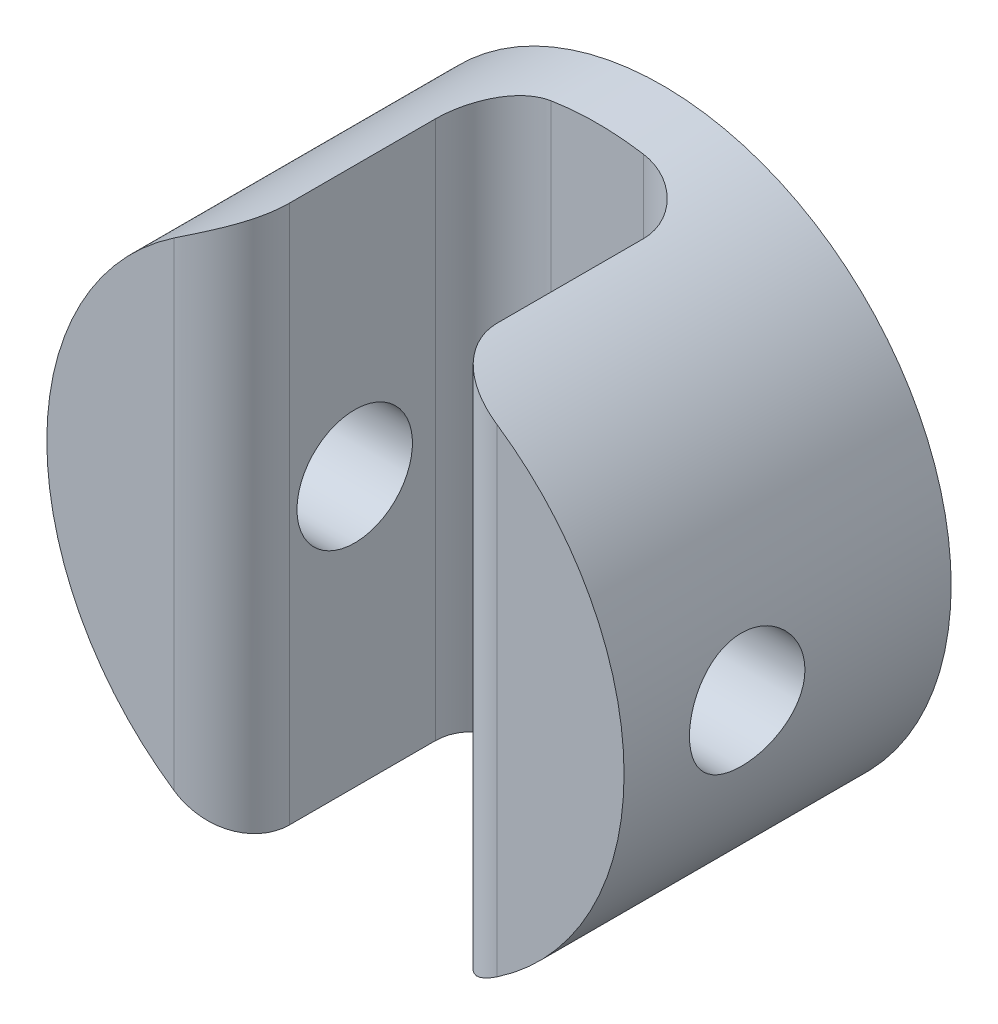
ISO-10303-21;
HEADER;
FILE_DESCRIPTION(('STEP AP214'),'2;1');
FILE_NAME('part.step','',(''),(''),'','','');
FILE_SCHEMA(('AUTOMOTIVE_DESIGN { 1 0 10303 214 1 1 1 1 }'));
ENDSEC;
DATA;
#1=APPLICATION_CONTEXT('core data for automotive mechanical design processes');
#2=APPLICATION_PROTOCOL_DEFINITION('international standard','automotive_design',2000,#1);
#3=PRODUCT_CONTEXT('',#1,'mechanical');
#4=PRODUCT('Part','Part','',(#3));
#5=PRODUCT_RELATED_PRODUCT_CATEGORY('part','',(#4));
#6=PRODUCT_DEFINITION_FORMATION('','',#4);
#7=PRODUCT_DEFINITION_CONTEXT('part definition',#1,'design');
#8=PRODUCT_DEFINITION('design','',#6,#7);
#9=PRODUCT_DEFINITION_SHAPE('','',#8);
#10=(LENGTH_UNIT() NAMED_UNIT(*) SI_UNIT(.MILLI.,.METRE.));
#11=(NAMED_UNIT(*) PLANE_ANGLE_UNIT() SI_UNIT($,.RADIAN.));
#12=(NAMED_UNIT(*) SI_UNIT($,.STERADIAN.) SOLID_ANGLE_UNIT());
#13=UNCERTAINTY_MEASURE_WITH_UNIT(LENGTH_MEASURE(1.E-05),#10,'distance_accuracy_value','');
#14=(GEOMETRIC_REPRESENTATION_CONTEXT(3) GLOBAL_UNCERTAINTY_ASSIGNED_CONTEXT((#13)) GLOBAL_UNIT_ASSIGNED_CONTEXT((#10,
#11,#12)) REPRESENTATION_CONTEXT('',''));
#15=CARTESIAN_POINT('',(0.,0.,0.));
#16=DIRECTION('',(0.,0.,1.));
#17=DIRECTION('',(1.,0.,0.));
#18=AXIS2_PLACEMENT_3D('',#15,#16,#17);
#19=CARTESIAN_POINT('',(0.,0.,8.5));
#20=DIRECTION('',(0.,0.,-1.));
#21=DIRECTION('',(-1.,0.,0.));
#22=AXIS2_PLACEMENT_3D('',#19,#20,#21);
#23=CYLINDRICAL_SURFACE('',#22,7.5);
#24=DIRECTION('',(0.,0.,-1.));
#25=VECTOR('',#24,1.);
#26=CARTESIAN_POINT('',(2.7,6.99714227381436,8.5));
#27=LINE('',#26,#25);
#28=CARTESIAN_POINT('',(2.7,6.99714227381436,3.2));
#29=VERTEX_POINT('',#28);
#30=CARTESIAN_POINT('',(2.7,6.99714227381436,7.));
#31=VERTEX_POINT('',#30);
#32=EDGE_CURVE('E105',#29,#31,#27,.F.);
#33=ORIENTED_EDGE('',*,*,#32,.T.);
#34=CARTESIAN_POINT('',(2.7,6.99714227381436,7.));
#35=CARTESIAN_POINT('',(2.69999901075075,6.99714064902579,7.03979783044758));
#36=CARTESIAN_POINT('',(2.70158501028902,6.99653088167752,7.07957622742591));
#37=CARTESIAN_POINT('',(2.70790371255194,6.99408853853974,7.15884000730107));
#38=CARTESIAN_POINT('',(2.7126360600533,6.99225610078986,7.19832542276677));
#39=CARTESIAN_POINT('',(2.73147700896505,6.9849285050591,7.31575484248));
#40=CARTESIAN_POINT('',(2.75022986375471,6.97760311004875,7.39289777237514));
#41=CARTESIAN_POINT('',(2.79938504908578,6.95802656053791,7.54267951383766));
#42=CARTESIAN_POINT('',(2.82978945530377,6.94577452835782,7.61531752019087));
#43=CARTESIAN_POINT('',(2.90104362961861,6.91631593994004,7.75418895254782));
#44=CARTESIAN_POINT('',(2.94189468728855,6.89910877198907,7.82042158645669));
#45=CARTESIAN_POINT('',(3.0331811240924,6.85946925692275,7.94585818579454));
#46=CARTESIAN_POINT('',(3.08375912976139,6.83695786148238,8.00493302945643));
#47=CARTESIAN_POINT('',(3.19212325955173,6.78703935801539,8.11358635338742));
#48=CARTESIAN_POINT('',(3.24990874943115,6.75963268067067,8.16316566826891));
#49=CARTESIAN_POINT('',(3.37412890684956,6.69852984317404,8.25467962144271));
#50=CARTESIAN_POINT('',(3.44086858461857,6.66456460641318,8.29601902238436));
#51=CARTESIAN_POINT('',(3.57797285348157,6.59197585145777,8.36713720085007));
#52=CARTESIAN_POINT('',(3.64834307662291,6.55334496291006,8.39689736512886));
#53=CARTESIAN_POINT('',(3.79928593747917,6.46713564934164,8.4479349962014));
#54=CARTESIAN_POINT('',(3.88006131293424,6.4190402548443,8.46774698073349));
#55=CARTESIAN_POINT('',(4.00074847013445,6.34399458254306,8.48726593628329));
#56=CARTESIAN_POINT('',(4.04084938347569,6.31852855187642,8.49207274598602));
#57=CARTESIAN_POINT('',(4.12071544362077,6.26673503591208,8.4984370225042));
#58=CARTESIAN_POINT('',(4.1604807961839,6.24040813540344,8.49999665039759));
#59=CARTESIAN_POINT('',(4.2,6.2136945531624,8.5));
#60=B_SPLINE_CURVE_WITH_KNOTS('',3,(#34,#35,#36,#37,#38,#39,#40,#41,#42,#43,#44,#45,#46,#47,#48,
#49,#50,#51,#52,#53,#54,#55,#56,#57,#58,#59),.UNSPECIFIED.,.F.,.F.,(4,2,2,2,2,2,2,2,2,2,2,2,4),
(0.,0.119318807319627,0.238624145810228,0.476566349535827,0.71455096141897,0.952564965191399,
1.1943795814936,1.43617293366244,1.69171953690056,1.94767524240694,2.23465635336297,
2.37779672895484,2.52084181067769),.UNSPECIFIED.);
#61=CARTESIAN_POINT('',(4.2,6.21369455316239,8.5));
#62=VERTEX_POINT('',#61);
#63=EDGE_CURVE('E182',#31,#62,#60,.T.);
#64=ORIENTED_EDGE('',*,*,#63,.T.);
#65=CARTESIAN_POINT('',(0.,0.,8.5));
#66=DIRECTION('',(0.,0.,1.));
#67=DIRECTION('',(1.,0.,0.));
#68=AXIS2_PLACEMENT_3D('',#65,#66,#67);
#69=CIRCLE('',#68,7.5);
#70=CARTESIAN_POINT('',(4.2,-6.21369455316239,8.5));
#71=VERTEX_POINT('',#70);
#72=EDGE_CURVE('E232',#71,#62,#69,.T.);
#73=ORIENTED_EDGE('',*,*,#72,.F.);
#74=CARTESIAN_POINT('',(4.2,-6.21369455316239,8.5));
#75=CARTESIAN_POINT('',(4.15611963408237,-6.24335706880683,8.49999551095912));
#76=CARTESIAN_POINT('',(4.11193392579509,-6.27254245859217,8.4980727699554));
#77=CARTESIAN_POINT('',(4.02317639226095,-6.32983747982932,8.49020992562932));
#78=CARTESIAN_POINT('',(3.97860428665225,-6.35794623289555,8.48426661286554));
#79=CARTESIAN_POINT('',(3.8442433054268,-6.44071822127688,8.46004678259562));
#80=CARTESIAN_POINT('',(3.75431648891797,-6.49348526769673,8.43537605340667));
#81=CARTESIAN_POINT('',(3.57714735550396,-6.59275324153459,8.36787754574778));
#82=CARTESIAN_POINT('',(3.48992121011476,-6.63922057200203,8.32495710494464));
#83=CARTESIAN_POINT('',(3.3230854103763,-6.72427226897459,8.22091254925804));
#84=CARTESIAN_POINT('',(3.24345115619362,-6.76288259028807,8.15985006531398));
#85=CARTESIAN_POINT('',(3.10615205089179,-6.82691681893976,8.03013961304627));
#86=CARTESIAN_POINT('',(3.04697280758879,-6.85341641231361,7.96362155036336));
#87=CARTESIAN_POINT('',(2.94049438580119,-6.89977364043884,7.81954570161062));
#88=CARTESIAN_POINT('',(2.89319851472378,-6.91962942657961,7.74198485147632));
#89=CARTESIAN_POINT('',(2.81708282160569,-6.95094029241974,7.58673420113851));
#90=CARTESIAN_POINT('',(2.78688022943815,-6.9630408785615,7.5098471274198));
#91=CARTESIAN_POINT('',(2.73946636114235,-6.98183249196476,7.35161451985347));
#92=CARTESIAN_POINT('',(2.72223154655002,-6.98853332217217,7.27027735299172));
#93=CARTESIAN_POINT('',(2.7078915799878,-6.99409280425032,7.15686890115941));
#94=CARTESIAN_POINT('',(2.70493192347099,-6.99523749777896,7.12555272553583));
#95=CARTESIAN_POINT('',(2.70098855793507,-6.99676106467131,7.06282946262944));
#96=CARTESIAN_POINT('',(2.70000160024017,-6.99714119713438,7.03142261025558));
#97=CARTESIAN_POINT('',(2.7,-6.99714227381436,7.));
#98=B_SPLINE_CURVE_WITH_KNOTS('',3,(#74,#75,#76,#77,#78,#79,#80,#81,#82,#83,#84,#85,#86,#87,#88,
#89,#90,#91,#92,#93,#94,#95,#96,#97),.UNSPECIFIED.,.F.,.F.,(4,2,2,2,2,2,2,2,2,2,2,4),(0.,
0.15882283075244,0.317772592455626,0.637484702239438,0.958839898167589,1.27911565274865,
1.55624736253,1.833456119011,2.08269305146702,2.33147648276226,2.42585064936943,
2.52006927043205),.UNSPECIFIED.);
#99=CARTESIAN_POINT('',(2.7,-6.99714227381436,7.));
#100=VERTEX_POINT('',#99);
#101=EDGE_CURVE('E175',#71,#100,#98,.T.);
#102=ORIENTED_EDGE('',*,*,#101,.T.);
#103=DIRECTION('',(0.,0.,-1.));
#104=VECTOR('',#103,1.);
#105=CARTESIAN_POINT('',(2.7,-6.99714227381436,8.5));
#106=LINE('',#105,#104);
#107=CARTESIAN_POINT('',(2.7,-6.99714227381436,3.2));
#108=VERTEX_POINT('',#107);
#109=EDGE_CURVE('E124',#100,#108,#106,.T.);
#110=ORIENTED_EDGE('',*,*,#109,.T.);
#111=CARTESIAN_POINT('',(2.7,-6.99714227381436,3.2));
#112=CARTESIAN_POINT('',(2.70000125296468,-6.99713962337673,3.15951193135814));
#113=CARTESIAN_POINT('',(2.69835961966364,-6.99777547046994,3.11904445299375));
#114=CARTESIAN_POINT('',(2.69182061132891,-7.00029429228222,3.03842269166137));
#115=CARTESIAN_POINT('',(2.68692406854953,-7.0021769482018,2.99826833128626));
#116=CARTESIAN_POINT('',(2.6674473057059,-7.00963114859332,2.87896692587078));
#117=CARTESIAN_POINT('',(2.64807939215009,-7.01700941231577,2.80065734306411));
#118=CARTESIAN_POINT('',(2.59731346685796,-7.03595660080242,2.64869052961801));
#119=CARTESIAN_POINT('',(2.56592139674573,-7.04752345565975,2.57503102209406));
#120=CARTESIAN_POINT('',(2.49214676702811,-7.07394765910813,2.43404351707832));
#121=CARTESIAN_POINT('',(2.44975788542509,-7.08880689975164,2.36671919208228));
#122=CARTESIAN_POINT('',(2.35348293661988,-7.12136130631972,2.23760765402669));
#123=CARTESIAN_POINT('',(2.29923237903798,-7.1391404613452,2.17611387785227));
#124=CARTESIAN_POINT('',(2.18167724451883,-7.17593721762506,2.06291061543522));
#125=CARTESIAN_POINT('',(2.11836942746737,-7.19495526074335,2.01120464609467));
#126=CARTESIAN_POINT('',(1.9807167592102,-7.23409546746183,1.91632205529297));
#127=CARTESIAN_POINT('',(1.90596781240558,-7.25422335189708,1.87373302516663));
#128=CARTESIAN_POINT('',(1.75008819624826,-7.29339688274251,1.80187285626729));
#129=CARTESIAN_POINT('',(1.6689614673731,-7.31244318506541,1.77259356882458));
#130=CARTESIAN_POINT('',(1.52314676077358,-7.34398524656892,1.73378947900306));
#131=CARTESIAN_POINT('',(1.45936512565716,-7.35693490282287,1.72116778239895));
#132=CARTESIAN_POINT('',(1.33045185722167,-7.38134590470554,1.70426624660359));
#133=CARTESIAN_POINT('',(1.26532067117927,-7.39280773457138,1.69998368691991));
#134=CARTESIAN_POINT('',(1.2,-7.40337760755184,1.7));
#135=B_SPLINE_CURVE_WITH_KNOTS('',3,(#111,#112,#113,#114,#115,#116,#117,#118,#119,#120,#121,
#122,#123,#124,#125,#126,#127,#128,#129,#130,#131,#132,#133,#134),.UNSPECIFIED.,.F.,.F.,(4,2,2,
2,2,2,2,2,2,2,2,4),(0.,0.121385706498105,0.242740387574913,0.484490084742728,0.726120477356751,
0.967890090784091,1.21852218084326,1.46924415644351,1.73308025163878,1.99675459927851,
2.19510940384687,2.39339948790345),.UNSPECIFIED.);
#136=CARTESIAN_POINT('',(1.2,-7.40337760755184,1.7));
#137=VERTEX_POINT('',#136);
#138=EDGE_CURVE('E112',#108,#137,#135,.T.);
#139=ORIENTED_EDGE('',*,*,#138,.T.);
#140=CARTESIAN_POINT('',(0.,0.,1.7));
#141=DIRECTION('',(0.,0.,-1.));
#142=DIRECTION('',(-1.,0.,0.));
#143=AXIS2_PLACEMENT_3D('',#140,#141,#142);
#144=CIRCLE('',#143,7.5);
#145=CARTESIAN_POINT('',(-1.2,-7.40337760755184,1.7));
#146=VERTEX_POINT('',#145);
#147=EDGE_CURVE('E132',#137,#146,#144,.T.);
#148=ORIENTED_EDGE('',*,*,#147,.T.);
#149=CARTESIAN_POINT('',(-1.2,-7.40337760755184,1.7));
#150=CARTESIAN_POINT('',(-1.24300927927867,-7.39640849561792,1.7000000568597));
#151=CARTESIAN_POINT('',(-1.28593375830723,-7.38906367404699,1.70185074555048));
#152=CARTESIAN_POINT('',(-1.37133566686447,-7.37369078453554,1.70920087043045));
#153=CARTESIAN_POINT('',(-1.41381319955502,-7.36566287832897,1.71469944499383));
#154=CARTESIAN_POINT('',(-1.53996823675266,-7.34069538736141,1.73655119518603));
#155=CARTESIAN_POINT('',(-1.62259723576248,-7.32283466137035,1.75826099514155));
#156=CARTESIAN_POINT('',(-1.78259670298157,-7.28554150519219,1.81515358479985));
#157=CARTESIAN_POINT('',(-1.85996925647975,-7.266109705047,1.85033099457077));
#158=CARTESIAN_POINT('',(-2.00762254649971,-7.2267069178112,1.93314950421742));
#159=CARTESIAN_POINT('',(-2.07790072689887,-7.20673573964301,1.98079507435218));
#160=CARTESIAN_POINT('',(-2.2109008172675,-7.16706624816437,2.08844715239278));
#161=CARTESIAN_POINT('',(-2.27343819870841,-7.14738193094582,2.14868712678051));
#162=CARTESIAN_POINT('',(-2.38747029866222,-7.11010494419513,2.27943742940958));
#163=CARTESIAN_POINT('',(-2.43896405509274,-7.09251245695541,2.34994865154868));
#164=CARTESIAN_POINT('',(-2.52856466520879,-7.06106160193352,2.49834332811706));
#165=CARTESIAN_POINT('',(-2.56685381662891,-7.04715305547881,2.57610583995719));
#166=CARTESIAN_POINT('',(-2.62957781524466,-7.0239911146211,2.73762983180682));
#167=CARTESIAN_POINT('',(-2.65403243666527,-7.01473107806937,2.82138255577644));
#168=CARTESIAN_POINT('',(-2.68066454324547,-7.00457983188053,2.95493712439231));
#169=CARTESIAN_POINT('',(-2.6879056220673,-7.00180026814942,3.00364119345118));
#170=CARTESIAN_POINT('',(-2.69757421982452,-6.99807854917595,3.10155359660865));
#171=CARTESIAN_POINT('',(-2.70000563709297,-6.99713490589123,3.15076148979982));
#172=CARTESIAN_POINT('',(-2.7,-6.99714227381436,3.2));
#173=B_SPLINE_CURVE_WITH_KNOTS('',3,(#149,#150,#151,#152,#153,#154,#155,#156,#157,#158,#159,
#160,#161,#162,#163,#164,#165,#166,#167,#168,#169,#170,#171,#172),.UNSPECIFIED.,.F.,.F.,(4,2,2,
2,2,2,2,2,2,2,2,4),(0.,0.130624585449255,0.261218328523449,0.521718653856982,0.782115025025229,
1.04260488535717,1.30843704825689,1.57429236013547,1.83631479735607,2.0979617634134,
2.24566938673828,2.39325724075668),.UNSPECIFIED.);
#174=CARTESIAN_POINT('',(-2.7,-6.99714227381436,3.2));
#175=VERTEX_POINT('',#174);
#176=EDGE_CURVE('E46',#146,#175,#173,.T.);
#177=ORIENTED_EDGE('',*,*,#176,.T.);
#178=DIRECTION('',(0.,0.,-1.));
#179=VECTOR('',#178,1.);
#180=CARTESIAN_POINT('',(-2.7,-6.99714227381436,8.5));
#181=LINE('',#180,#179);
#182=CARTESIAN_POINT('',(-2.7,-6.99714227381436,7.));
#183=VERTEX_POINT('',#182);
#184=EDGE_CURVE('E229',#175,#183,#181,.F.);
#185=ORIENTED_EDGE('',*,*,#184,.T.);
#186=CARTESIAN_POINT('',(-2.7,-6.99714227381436,7.));
#187=CARTESIAN_POINT('',(-2.69999901075075,-6.99714064902579,7.03979783044758));
#188=CARTESIAN_POINT('',(-2.70158501028902,-6.99653088167752,7.07957622742591));
#189=CARTESIAN_POINT('',(-2.70790371255194,-6.99408853853974,7.15884000730107));
#190=CARTESIAN_POINT('',(-2.7126360600533,-6.99225610078986,7.19832542276677));
#191=CARTESIAN_POINT('',(-2.73147700896505,-6.9849285050591,7.31575484248));
#192=CARTESIAN_POINT('',(-2.75022986375471,-6.97760311004875,7.39289777237514));
#193=CARTESIAN_POINT('',(-2.79938504908578,-6.95802656053791,7.54267951383766));
#194=CARTESIAN_POINT('',(-2.82978945530377,-6.94577452835782,7.61531752019087));
#195=CARTESIAN_POINT('',(-2.90104362961861,-6.91631593994004,7.75418895254782));
#196=CARTESIAN_POINT('',(-2.94189468728855,-6.89910877198907,7.82042158645669));
#197=CARTESIAN_POINT('',(-3.0331811240924,-6.85946925692275,7.94585818579454));
#198=CARTESIAN_POINT('',(-3.08375912976139,-6.83695786148238,8.00493302945643));
#199=CARTESIAN_POINT('',(-3.19212325955173,-6.78703935801539,8.11358635338742));
#200=CARTESIAN_POINT('',(-3.24990874943115,-6.75963268067067,8.16316566826891));
#201=CARTESIAN_POINT('',(-3.37412890684956,-6.69852984317404,8.25467962144271));
#202=CARTESIAN_POINT('',(-3.44086858461857,-6.66456460641318,8.29601902238436));
#203=CARTESIAN_POINT('',(-3.57797285348157,-6.59197585145777,8.36713720085007));
#204=CARTESIAN_POINT('',(-3.64834307662291,-6.55334496291006,8.39689736512886));
#205=CARTESIAN_POINT('',(-3.79928593747917,-6.46713564934164,8.4479349962014));
#206=CARTESIAN_POINT('',(-3.88006131293424,-6.4190402548443,8.46774698073349));
#207=CARTESIAN_POINT('',(-4.00074847013445,-6.34399458254306,8.48726593628329));
#208=CARTESIAN_POINT('',(-4.04084938347569,-6.31852855187643,8.49207274598602));
#209=CARTESIAN_POINT('',(-4.12071544362077,-6.26673503591208,8.4984370225042));
#210=CARTESIAN_POINT('',(-4.1604807961839,-6.24040813540344,8.49999665039759));
#211=CARTESIAN_POINT('',(-4.2,-6.2136945531624,8.5));
#212=B_SPLINE_CURVE_WITH_KNOTS('',3,(#186,#187,#188,#189,#190,#191,#192,#193,#194,#195,#196,
#197,#198,#199,#200,#201,#202,#203,#204,#205,#206,#207,#208,#209,#210,#211),.UNSPECIFIED.,.F.,
.F.,(4,2,2,2,2,2,2,2,2,2,2,2,4),(0.,0.119318807319627,0.238624145810228,0.476566349535827,
0.714550961418972,0.952564965191399,1.1943795814936,1.43617293366244,1.69171953690056,
1.94767524240693,2.23465635336297,2.37779672895484,2.52084181067768),.UNSPECIFIED.);
#213=CARTESIAN_POINT('',(-4.2,-6.21369455316239,8.5));
#214=VERTEX_POINT('',#213);
#215=EDGE_CURVE('E53',#183,#214,#212,.T.);
#216=ORIENTED_EDGE('',*,*,#215,.T.);
#217=CARTESIAN_POINT('',(-4.2,6.21369455316239,8.5));
#218=VERTEX_POINT('',#217);
#219=EDGE_CURVE('E227',#218,#214,#69,.T.);
#220=ORIENTED_EDGE('',*,*,#219,.F.);
#221=CARTESIAN_POINT('',(-4.2,6.21369455316239,8.5));
#222=CARTESIAN_POINT('',(-4.15611963408237,6.24335706880683,8.49999551095912));
#223=CARTESIAN_POINT('',(-4.11193392579509,6.27254245859217,8.4980727699554));
#224=CARTESIAN_POINT('',(-4.02317639226095,6.32983747982932,8.49020992562932));
#225=CARTESIAN_POINT('',(-3.97860428665225,6.35794623289555,8.48426661286554));
#226=CARTESIAN_POINT('',(-3.8442433054268,6.44071822127688,8.46004678259562));
#227=CARTESIAN_POINT('',(-3.75431648891797,6.49348526769673,8.43537605340667));
#228=CARTESIAN_POINT('',(-3.57714735550396,6.59275324153459,8.36787754574778));
#229=CARTESIAN_POINT('',(-3.48992121011476,6.63922057200203,8.32495710494464));
#230=CARTESIAN_POINT('',(-3.3230854103763,6.72427226897459,8.22091254925804));
#231=CARTESIAN_POINT('',(-3.24345115619362,6.76288259028807,8.15985006531398));
#232=CARTESIAN_POINT('',(-3.10615205089179,6.82691681893976,8.03013961304627));
#233=CARTESIAN_POINT('',(-3.04697280758879,6.85341641231361,7.96362155036336));
#234=CARTESIAN_POINT('',(-2.94049438580119,6.89977364043884,7.81954570161062));
#235=CARTESIAN_POINT('',(-2.89319851472378,6.91962942657961,7.74198485147632));
#236=CARTESIAN_POINT('',(-2.81708282160569,6.95094029241974,7.58673420113851));
#237=CARTESIAN_POINT('',(-2.78688022943815,6.96304087856151,7.5098471274198));
#238=CARTESIAN_POINT('',(-2.73946636114234,6.98183249196477,7.35161451985347));
#239=CARTESIAN_POINT('',(-2.72223154655002,6.98853332217217,7.27027735299172));
#240=CARTESIAN_POINT('',(-2.7078915799878,6.99409280425032,7.15686890115941));
#241=CARTESIAN_POINT('',(-2.70493192347099,6.99523749777896,7.12555272553582));
#242=CARTESIAN_POINT('',(-2.70098855793507,6.99676106467131,7.06282946262944));
#243=CARTESIAN_POINT('',(-2.70000160024017,6.99714119713438,7.03142261025558));
#244=CARTESIAN_POINT('',(-2.7,6.99714227381436,7.));
#245=B_SPLINE_CURVE_WITH_KNOTS('',3,(#221,#222,#223,#224,#225,#226,#227,#228,#229,#230,#231,
#232,#233,#234,#235,#236,#237,#238,#239,#240,#241,#242,#243,#244),.UNSPECIFIED.,.F.,.F.,(4,2,2,
2,2,2,2,2,2,2,2,4),(0.,0.15882283075244,0.317772592455626,0.637484702239438,0.958839898167589,
1.27911565274865,1.55624736253,1.833456119011,2.08269305146702,2.33147648276226,
2.42585064936943,2.52006927043205),.UNSPECIFIED.);
#246=CARTESIAN_POINT('',(-2.7,6.99714227381436,7.));
#247=VERTEX_POINT('',#246);
#248=EDGE_CURVE('E130',#218,#247,#245,.T.);
#249=ORIENTED_EDGE('',*,*,#248,.T.);
#250=DIRECTION('',(0.,0.,-1.));
#251=VECTOR('',#250,1.);
#252=CARTESIAN_POINT('',(-2.7,6.99714227381436,8.5));
#253=LINE('',#252,#251);
#254=CARTESIAN_POINT('',(-2.7,6.99714227381436,3.2));
#255=VERTEX_POINT('',#254);
#256=EDGE_CURVE('E248',#247,#255,#253,.T.);
#257=ORIENTED_EDGE('',*,*,#256,.T.);
#258=CARTESIAN_POINT('',(-2.7,6.99714227381436,3.2));
#259=CARTESIAN_POINT('',(-2.70000125296468,6.99713962337673,3.15951193135814));
#260=CARTESIAN_POINT('',(-2.69835961966364,6.99777547046994,3.11904445299375));
#261=CARTESIAN_POINT('',(-2.69182061132891,7.00029429228222,3.03842269166137));
#262=CARTESIAN_POINT('',(-2.68692406854953,7.0021769482018,2.99826833128626));
#263=CARTESIAN_POINT('',(-2.6674473057059,7.00963114859332,2.87896692587078));
#264=CARTESIAN_POINT('',(-2.64807939215009,7.01700941231577,2.80065734306411));
#265=CARTESIAN_POINT('',(-2.59731346685796,7.03595660080242,2.64869052961801));
#266=CARTESIAN_POINT('',(-2.56592139674573,7.04752345565975,2.57503102209406));
#267=CARTESIAN_POINT('',(-2.49214676702811,7.07394765910813,2.43404351707832));
#268=CARTESIAN_POINT('',(-2.44975788542509,7.08880689975164,2.36671919208229));
#269=CARTESIAN_POINT('',(-2.35348293661988,7.12136130631972,2.23760765402669));
#270=CARTESIAN_POINT('',(-2.29923237903798,7.1391404613452,2.17611387785227));
#271=CARTESIAN_POINT('',(-2.18167724451883,7.17593721762506,2.06291061543522));
#272=CARTESIAN_POINT('',(-2.11836942746737,7.19495526074335,2.01120464609467));
#273=CARTESIAN_POINT('',(-1.9807167592102,7.23409546746183,1.91632205529297));
#274=CARTESIAN_POINT('',(-1.90596781240558,7.25422335189708,1.87373302516663));
#275=CARTESIAN_POINT('',(-1.75008819624826,7.29339688274251,1.80187285626729));
#276=CARTESIAN_POINT('',(-1.6689614673731,7.31244318506541,1.77259356882458));
#277=CARTESIAN_POINT('',(-1.52314676077358,7.34398524656892,1.73378947900306));
#278=CARTESIAN_POINT('',(-1.45936512565716,7.35693490282287,1.72116778239895));
#279=CARTESIAN_POINT('',(-1.33045185722167,7.38134590470554,1.70426624660359));
#280=CARTESIAN_POINT('',(-1.26532067117927,7.39280773457138,1.69998368691991));
#281=CARTESIAN_POINT('',(-1.2,7.40337760755184,1.7));
#282=B_SPLINE_CURVE_WITH_KNOTS('',3,(#258,#259,#260,#261,#262,#263,#264,#265,#266,#267,#268,
#269,#270,#271,#272,#273,#274,#275,#276,#277,#278,#279,#280,#281),.UNSPECIFIED.,.F.,.F.,(4,2,2,
2,2,2,2,2,2,2,2,4),(0.,0.121385706498105,0.242740387574913,0.484490084742728,0.72612047735675,
0.967890090784091,1.21852218084326,1.46924415644351,1.73308025163878,1.99675459927851,
2.19510940384687,2.39339948790345),.UNSPECIFIED.);
#283=CARTESIAN_POINT('',(-1.2,7.40337760755184,1.7));
#284=VERTEX_POINT('',#283);
#285=EDGE_CURVE('E11',#255,#284,#282,.T.);
#286=ORIENTED_EDGE('',*,*,#285,.T.);
#287=CARTESIAN_POINT('',(1.2,7.40337760755184,1.7));
#288=VERTEX_POINT('',#287);
#289=EDGE_CURVE('E107',#284,#288,#144,.T.);
#290=ORIENTED_EDGE('',*,*,#289,.T.);
#291=CARTESIAN_POINT('',(1.2,7.40337760755184,1.7));
#292=CARTESIAN_POINT('',(1.24300927927867,7.39640849561792,1.7000000568597));
#293=CARTESIAN_POINT('',(1.28593375830723,7.38906367404699,1.70185074555048));
#294=CARTESIAN_POINT('',(1.37133566686447,7.37369078453555,1.70920087043045));
#295=CARTESIAN_POINT('',(1.41381319955502,7.36566287832897,1.71469944499383));
#296=CARTESIAN_POINT('',(1.53996823675266,7.34069538736141,1.73655119518603));
#297=CARTESIAN_POINT('',(1.62259723576248,7.32283466137035,1.75826099514155));
#298=CARTESIAN_POINT('',(1.78259670298157,7.28554150519219,1.81515358479985));
#299=CARTESIAN_POINT('',(1.85996925647975,7.266109705047,1.85033099457077));
#300=CARTESIAN_POINT('',(2.00762254649971,7.2267069178112,1.93314950421742));
#301=CARTESIAN_POINT('',(2.07790072689887,7.20673573964301,1.98079507435218));
#302=CARTESIAN_POINT('',(2.21090081726749,7.16706624816437,2.08844715239278));
#303=CARTESIAN_POINT('',(2.27343819870841,7.14738193094582,2.14868712678051));
#304=CARTESIAN_POINT('',(2.38747029866222,7.11010494419513,2.27943742940958));
#305=CARTESIAN_POINT('',(2.43896405509274,7.09251245695541,2.34994865154868));
#306=CARTESIAN_POINT('',(2.52856466520879,7.06106160193352,2.49834332811706));
#307=CARTESIAN_POINT('',(2.56685381662891,7.04715305547881,2.57610583995719));
#308=CARTESIAN_POINT('',(2.62957781524466,7.0239911146211,2.73762983180682));
#309=CARTESIAN_POINT('',(2.65403243666527,7.01473107806937,2.82138255577644));
#310=CARTESIAN_POINT('',(2.68066454324547,7.00457983188053,2.95493712439231));
#311=CARTESIAN_POINT('',(2.6879056220673,7.00180026814942,3.00364119345117));
#312=CARTESIAN_POINT('',(2.69757421982452,6.99807854917595,3.10155359660865));
#313=CARTESIAN_POINT('',(2.70000563709297,6.99713490589123,3.15076148979982));
#314=CARTESIAN_POINT('',(2.7,6.99714227381436,3.2));
#315=B_SPLINE_CURVE_WITH_KNOTS('',3,(#291,#292,#293,#294,#295,#296,#297,#298,#299,#300,#301,
#302,#303,#304,#305,#306,#307,#308,#309,#310,#311,#312,#313,#314),.UNSPECIFIED.,.F.,.F.,(4,2,2,
2,2,2,2,2,2,2,2,4),(0.,0.130624585449255,0.261218328523449,0.521718653856982,0.782115025025229,
1.04260488535717,1.30843704825689,1.57429236013547,1.83631479735607,2.0979617634134,
2.24566938673827,2.39325724075668),.UNSPECIFIED.);
#316=EDGE_CURVE('E102',#288,#29,#315,.T.);
#317=ORIENTED_EDGE('',*,*,#316,.T.);
#318=EDGE_LOOP('',(#33,#64,#73,#102,#110,#139,#148,#177,#185,#216,#220,#249,#257,#286,#290,#317));
#319=FACE_BOUND('',#318,.T.);
#320=CARTESIAN_POINT('',(0.,0.,0.));
#321=DIRECTION('',(0.,0.,1.));
#322=DIRECTION('',(1.,0.,0.));
#323=AXIS2_PLACEMENT_3D('',#320,#321,#322);
#324=CIRCLE('',#323,7.5);
#325=CARTESIAN_POINT('',(7.5,0.,0.));
#326=VERTEX_POINT('',#325);
#327=EDGE_CURVE('E246',#326,#326,#324,.T.);
#328=ORIENTED_EDGE('',*,*,#327,.T.);
#329=EDGE_LOOP('',(#328));
#330=FACE_BOUND('',#329,.T.);
#331=CARTESIAN_POINT('',(-7.5,0.,6.8));
#332=CARTESIAN_POINT('',(-7.49999846371306,0.0833653601889499,6.79999693325248));
#333=CARTESIAN_POINT('',(-7.49859577767346,0.166769490302284,6.79302673554853));
#334=CARTESIAN_POINT('',(-7.49313548434847,0.331220261533529,6.76535224982713));
#335=CARTESIAN_POINT('',(-7.48907576790279,0.412264976312034,6.74463705079774));
#336=CARTESIAN_POINT('',(-7.4787547391743,0.569595457894969,6.69013808956882));
#337=CARTESIAN_POINT('',(-7.47249553615077,0.645885701899701,6.65636684473297));
#338=CARTESIAN_POINT('',(-7.45845597052971,0.791711983296338,6.57675162873306));
#339=CARTESIAN_POINT('',(-7.4506756985356,0.861248422613718,6.53090837658919));
#340=CARTESIAN_POINT('',(-7.43433247994955,0.992540215972298,6.42779225856285));
#341=CARTESIAN_POINT('',(-7.42576118256521,1.05419092673779,6.3703874669132));
#342=CARTESIAN_POINT('',(-7.40886270678882,1.16705513491204,6.24606137541245));
#343=CARTESIAN_POINT('',(-7.40053554750636,1.21826781715564,6.17913933299732));
#344=CARTESIAN_POINT('',(-7.38498662718923,1.30924763002143,6.03692571048219));
#345=CARTESIAN_POINT('',(-7.37777561047419,1.3489064082988,5.96156353430546));
#346=CARTESIAN_POINT('',(-7.36539402087627,1.41495849987046,5.80507727149388));
#347=CARTESIAN_POINT('',(-7.36022324642942,1.44135312365586,5.72395375498049));
#348=CARTESIAN_POINT('',(-7.35259207878307,1.47978794982724,5.55937345413813));
#349=CARTESIAN_POINT('',(-7.35009705160781,1.49201174693817,5.47596118378666));
#350=CARTESIAN_POINT('',(-7.34799562590941,1.50232819158918,5.30823526795349));
#351=CARTESIAN_POINT('',(-7.34838893201761,1.50042228407025,5.22392171551978));
#352=CARTESIAN_POINT('',(-7.35198826722277,1.48268185965273,5.0581298179685));
#353=CARTESIAN_POINT('',(-7.35515179288145,1.46705781036586,4.97662789155903));
#354=CARTESIAN_POINT('',(-7.36386819240002,1.42265682693458,4.8174258850055));
#355=CARTESIAN_POINT('',(-7.36942118036668,1.39387926465102,4.73972598662149));
#356=CARTESIAN_POINT('',(-7.38233427750612,1.32378717551208,4.5897271074446));
#357=CARTESIAN_POINT('',(-7.38970634720557,1.28238922684817,4.51746818064624));
#358=CARTESIAN_POINT('',(-7.40541928159593,1.18829036185902,4.38084372504078));
#359=CARTESIAN_POINT('',(-7.41376025757549,1.13558814653524,4.31647910472326));
#360=CARTESIAN_POINT('',(-7.43065531862193,1.01924990184088,4.1962558963146));
#361=CARTESIAN_POINT('',(-7.43921053816357,0.955434241818668,4.14057114821131));
#362=CARTESIAN_POINT('',(-7.45543273071613,0.819277536093015,4.04066923054816));
#363=CARTESIAN_POINT('',(-7.4630996923346,0.746936381069084,3.99645220805963));
#364=CARTESIAN_POINT('',(-7.47670035241331,0.595589080318381,3.92070873616104));
#365=CARTESIAN_POINT('',(-7.48263133272408,0.51657272937795,3.8892021595332));
#366=CARTESIAN_POINT('',(-7.49207113481787,0.354223464672998,3.83995928894215));
#367=CARTESIAN_POINT('',(-7.49558025000797,0.270891075108675,3.82222132688956));
#368=CARTESIAN_POINT('',(-7.49974007800301,0.103769108440726,3.80126531930858));
#369=CARTESIAN_POINT('',(-7.50043761978705,0.0200104924883646,3.7978093706896));
#370=CARTESIAN_POINT('',(-7.49902577895154,-0.146887401289071,3.80487478841327));
#371=CARTESIAN_POINT('',(-7.49691655412169,-0.23002671366569,3.81539536902889));
#372=CARTESIAN_POINT('',(-7.49015748012026,-0.392558489919811,3.84991756031593));
#373=CARTESIAN_POINT('',(-7.4855306460631,-0.471977922509854,3.87379710274685));
#374=CARTESIAN_POINT('',(-7.47425328091549,-0.625685441249501,3.93422597398371));
#375=CARTESIAN_POINT('',(-7.4676025982134,-0.699973142456309,3.97077625201524));
#376=CARTESIAN_POINT('',(-7.45289867299942,-0.842311760529326,4.05602373597697));
#377=CARTESIAN_POINT('',(-7.44482925655578,-0.910275190128282,4.10486417155842));
#378=CARTESIAN_POINT('',(-7.42822102244824,-1.03712702867881,4.21311378681092));
#379=CARTESIAN_POINT('',(-7.41968215452582,-1.09601446339614,4.2725240995998));
#380=CARTESIAN_POINT('',(-7.40293955335447,-1.20396088616126,4.40131002783669));
#381=CARTESIAN_POINT('',(-7.39474290349956,-1.25285655367298,4.47082361633201));
#382=CARTESIAN_POINT('',(-7.37976287694291,-1.33827813007681,4.61721704203502));
#383=CARTESIAN_POINT('',(-7.37297944370014,-1.37480453388435,4.69409658436033));
#384=CARTESIAN_POINT('',(-7.36165110876574,-1.43422776237294,4.85265236922432));
#385=CARTESIAN_POINT('',(-7.3570946230828,-1.45719524968658,4.93430126181548));
#386=CARTESIAN_POINT('',(-7.35071155188038,-1.48906297744079,5.10040018023636));
#387=CARTESIAN_POINT('',(-7.34888461036667,-1.49796505233767,5.18484983931402));
#388=CARTESIAN_POINT('',(-7.34818724447069,-1.5013813663012,5.35251329681648));
#389=CARTESIAN_POINT('',(-7.34926378783951,-1.49615368210634,5.43572172339051));
#390=CARTESIAN_POINT('',(-7.35413360226921,-1.47202845615009,5.60004747485754));
#391=CARTESIAN_POINT('',(-7.35792685150754,-1.45313102419395,5.68116481654221));
#392=CARTESIAN_POINT('',(-7.36777896328738,-1.40231785274843,5.83884156686082));
#393=CARTESIAN_POINT('',(-7.37383231528246,-1.37043376007602,5.91541154075362));
#394=CARTESIAN_POINT('',(-7.38752572461255,-1.29458196690241,6.06215558110166));
#395=CARTESIAN_POINT('',(-7.39516591498341,-1.25061325316232,6.13232911058771));
#396=CARTESIAN_POINT('',(-7.41133440784838,-1.15095887217962,6.26557335822547));
#397=CARTESIAN_POINT('',(-7.41987559364549,-1.09508683085277,6.32850314790139));
#398=CARTESIAN_POINT('',(-7.43679122807932,-0.973596553519712,6.44417930829376));
#399=CARTESIAN_POINT('',(-7.44516563794777,-0.907976080730003,6.49692333547591));
#400=CARTESIAN_POINT('',(-7.46090748581957,-0.76802644363237,6.59125196591967));
#401=CARTESIAN_POINT('',(-7.46826346828869,-0.693613326644752,6.63271400492004));
#402=CARTESIAN_POINT('',(-7.481026876275,-0.538749541411099,6.70247918389489));
#403=CARTESIAN_POINT('',(-7.48643605707924,-0.45830439129469,6.73079418429874));
#404=CARTESIAN_POINT('',(-7.49364558893056,-0.31473223338567,6.76797792206708));
#405=CARTESIAN_POINT('',(-7.49601454737677,-0.252422496020677,6.77996479056164));
#406=CARTESIAN_POINT('',(-7.49919231209839,-0.126749287815101,6.79597686853755));
#407=CARTESIAN_POINT('',(-7.50000116809732,-0.0633858506229286,6.80000233176465));
#408=CARTESIAN_POINT('',(-7.5,0.,6.8));
#409=B_SPLINE_CURVE_WITH_KNOTS('',3,(#331,#332,#333,#334,#335,#336,#337,#338,#339,#340,#341,
#342,#343,#344,#345,#346,#347,#348,#349,#350,#351,#352,#353,#354,#355,#356,#357,#358,#359,#360,
#361,#362,#363,#364,#365,#366,#367,#368,#369,#370,#371,#372,#373,#374,#375,#376,#377,#378,#379,
#380,#381,#382,#383,#384,#385,#386,#387,#388,#389,#390,#391,#392,#393,#394,#395,#396,#397,#398,
#399,#400,#401,#402,#403,#404,#405,#406,#407,#408),.UNSPECIFIED.,.T.,.F.,(4,2,2,2,2,2,2,2,2,2,2,
2,2,2,2,2,2,2,2,2,2,2,2,2,2,2,2,2,2,2,2,2,2,2,2,2,2,2,4),(0.,0.249864195991888,
0.499926976036985,0.749750602875512,0.999559353346295,1.25239900516828,1.50525839512105,
1.76041792508884,2.01555224047796,2.26734277655381,2.51910756421838,2.76707590509417,
3.01505608880595,3.26471235305389,3.51439732124506,3.76857378737026,4.02275351309731,
4.27732912281036,4.53187388547054,4.78216103514398,5.03243411486801,5.28045680926085,
5.52849808824034,5.77957599050038,6.03068082518895,6.28560942868839,6.540527830852,
6.79410571549085,7.04765052495622,7.29659583851552,7.54553915238913,7.79387941879665,
8.042240513728,8.29482114358715,8.54745981799396,8.80274245013456,9.05779433276278,
9.24778162934841,9.43776287056495),.UNSPECIFIED.);
#410=CARTESIAN_POINT('',(-7.5,0.,6.8));
#411=VERTEX_POINT('',#410);
#412=EDGE_CURVE('E160',#411,#411,#409,.T.);
#413=ORIENTED_EDGE('',*,*,#412,.F.);
#414=EDGE_LOOP('',(#413));
#415=FACE_BOUND('',#414,.T.);
#416=CARTESIAN_POINT('',(7.5,0.,6.8));
#417=CARTESIAN_POINT('',(7.49999846371307,-0.0833653601889499,6.79999693325248));
#418=CARTESIAN_POINT('',(7.49859577767346,-0.166769490302284,6.79302673554853));
#419=CARTESIAN_POINT('',(7.49313548434847,-0.331220261533529,6.76535224982713));
#420=CARTESIAN_POINT('',(7.48907576790279,-0.412264976312034,6.74463705079774));
#421=CARTESIAN_POINT('',(7.4787547391743,-0.56959545789497,6.69013808956882));
#422=CARTESIAN_POINT('',(7.47249553615077,-0.645885701899702,6.65636684473297));
#423=CARTESIAN_POINT('',(7.45845597052971,-0.791711983296339,6.57675162873306));
#424=CARTESIAN_POINT('',(7.4506756985356,-0.861248422613718,6.53090837658919));
#425=CARTESIAN_POINT('',(7.43433247994955,-0.992540215972298,6.42779225856285));
#426=CARTESIAN_POINT('',(7.42576118256521,-1.05419092673779,6.3703874669132));
#427=CARTESIAN_POINT('',(7.40886270678882,-1.16705513491204,6.24606137541245));
#428=CARTESIAN_POINT('',(7.40053554750636,-1.21826781715564,6.17913933299732));
#429=CARTESIAN_POINT('',(7.38498662718923,-1.30924763002143,6.03692571048219));
#430=CARTESIAN_POINT('',(7.37777561047419,-1.3489064082988,5.96156353430546));
#431=CARTESIAN_POINT('',(7.36539402087627,-1.41495849987046,5.80507727149388));
#432=CARTESIAN_POINT('',(7.36022324642942,-1.44135312365586,5.72395375498048));
#433=CARTESIAN_POINT('',(7.35259207878307,-1.47978794982724,5.55937345413813));
#434=CARTESIAN_POINT('',(7.35009705160781,-1.49201174693817,5.47596118378666));
#435=CARTESIAN_POINT('',(7.34799562590941,-1.50232819158918,5.30823526795349));
#436=CARTESIAN_POINT('',(7.34838893201761,-1.50042228407025,5.22392171551978));
#437=CARTESIAN_POINT('',(7.35198826722277,-1.48268185965273,5.0581298179685));
#438=CARTESIAN_POINT('',(7.35515179288145,-1.46705781036586,4.97662789155903));
#439=CARTESIAN_POINT('',(7.36386819240002,-1.42265682693458,4.8174258850055));
#440=CARTESIAN_POINT('',(7.36942118036668,-1.39387926465102,4.73972598662149));
#441=CARTESIAN_POINT('',(7.38233427750612,-1.32378717551208,4.5897271074446));
#442=CARTESIAN_POINT('',(7.38970634720557,-1.28238922684817,4.51746818064624));
#443=CARTESIAN_POINT('',(7.40541928159593,-1.18829036185902,4.38084372504078));
#444=CARTESIAN_POINT('',(7.41376025757549,-1.13558814653524,4.31647910472326));
#445=CARTESIAN_POINT('',(7.43065531862193,-1.01924990184088,4.1962558963146));
#446=CARTESIAN_POINT('',(7.43921053816357,-0.955434241818668,4.14057114821131));
#447=CARTESIAN_POINT('',(7.45543273071613,-0.819277536093015,4.04066923054816));
#448=CARTESIAN_POINT('',(7.4630996923346,-0.746936381069084,3.99645220805963));
#449=CARTESIAN_POINT('',(7.47670035241331,-0.595589080318381,3.92070873616104));
#450=CARTESIAN_POINT('',(7.48263133272408,-0.516572729377951,3.8892021595332));
#451=CARTESIAN_POINT('',(7.49207113481787,-0.354223464672998,3.83995928894215));
#452=CARTESIAN_POINT('',(7.49558025000797,-0.270891075108675,3.82222132688956));
#453=CARTESIAN_POINT('',(7.49974007800301,-0.103769108440726,3.80126531930858));
#454=CARTESIAN_POINT('',(7.50043761978705,-0.0200104924883648,3.7978093706896));
#455=CARTESIAN_POINT('',(7.49902577895154,0.146887401289071,3.80487478841327));
#456=CARTESIAN_POINT('',(7.49691655412169,0.230026713665689,3.81539536902889));
#457=CARTESIAN_POINT('',(7.49015748012026,0.392558489919811,3.84991756031593));
#458=CARTESIAN_POINT('',(7.4855306460631,0.471977922509854,3.87379710274685));
#459=CARTESIAN_POINT('',(7.47425328091549,0.625685441249501,3.93422597398371));
#460=CARTESIAN_POINT('',(7.4676025982134,0.699973142456309,3.97077625201524));
#461=CARTESIAN_POINT('',(7.45289867299942,0.842311760529326,4.05602373597697));
#462=CARTESIAN_POINT('',(7.44482925655578,0.910275190128282,4.10486417155842));
#463=CARTESIAN_POINT('',(7.42822102244824,1.03712702867881,4.21311378681092));
#464=CARTESIAN_POINT('',(7.41968215452582,1.09601446339614,4.2725240995998));
#465=CARTESIAN_POINT('',(7.40293955335447,1.20396088616126,4.40131002783669));
#466=CARTESIAN_POINT('',(7.39474290349956,1.25285655367298,4.47082361633201));
#467=CARTESIAN_POINT('',(7.37976287694291,1.33827813007681,4.61721704203502));
#468=CARTESIAN_POINT('',(7.37297944370014,1.37480453388435,4.69409658436033));
#469=CARTESIAN_POINT('',(7.36165110876574,1.43422776237294,4.85265236922432));
#470=CARTESIAN_POINT('',(7.3570946230828,1.45719524968658,4.93430126181548));
#471=CARTESIAN_POINT('',(7.35071155188038,1.48906297744079,5.10040018023636));
#472=CARTESIAN_POINT('',(7.34888461036667,1.49796505233767,5.18484983931402));
#473=CARTESIAN_POINT('',(7.34818724447069,1.5013813663012,5.35251329681648));
#474=CARTESIAN_POINT('',(7.34926378783951,1.49615368210634,5.43572172339051));
#475=CARTESIAN_POINT('',(7.35413360226921,1.47202845615009,5.60004747485754));
#476=CARTESIAN_POINT('',(7.35792685150754,1.45313102419395,5.68116481654221));
#477=CARTESIAN_POINT('',(7.36777896328738,1.40231785274843,5.83884156686082));
#478=CARTESIAN_POINT('',(7.37383231528246,1.37043376007602,5.91541154075362));
#479=CARTESIAN_POINT('',(7.38752572461255,1.29458196690241,6.06215558110166));
#480=CARTESIAN_POINT('',(7.39516591498341,1.25061325316232,6.13232911058771));
#481=CARTESIAN_POINT('',(7.41133440784838,1.15095887217962,6.26557335822547));
#482=CARTESIAN_POINT('',(7.41987559364549,1.09508683085277,6.32850314790139));
#483=CARTESIAN_POINT('',(7.43679122807932,0.973596553519712,6.44417930829376));
#484=CARTESIAN_POINT('',(7.44516563794777,0.907976080730003,6.49692333547591));
#485=CARTESIAN_POINT('',(7.46090748581957,0.76802644363237,6.59125196591967));
#486=CARTESIAN_POINT('',(7.46826346828869,0.693613326644752,6.63271400492004));
#487=CARTESIAN_POINT('',(7.481026876275,0.538749541411099,6.70247918389489));
#488=CARTESIAN_POINT('',(7.48643605707924,0.45830439129469,6.73079418429874));
#489=CARTESIAN_POINT('',(7.49364558893056,0.31473223338567,6.76797792206708));
#490=CARTESIAN_POINT('',(7.49601454737678,0.252422496020678,6.77996479056164));
#491=CARTESIAN_POINT('',(7.49919231209839,0.126749287815101,6.79597686853755));
#492=CARTESIAN_POINT('',(7.50000116809732,0.063385850622929,6.80000233176465));
#493=CARTESIAN_POINT('',(7.5,0.,6.8));
#494=B_SPLINE_CURVE_WITH_KNOTS('',3,(#416,#417,#418,#419,#420,#421,#422,#423,#424,#425,#426,
#427,#428,#429,#430,#431,#432,#433,#434,#435,#436,#437,#438,#439,#440,#441,#442,#443,#444,#445,
#446,#447,#448,#449,#450,#451,#452,#453,#454,#455,#456,#457,#458,#459,#460,#461,#462,#463,#464,
#465,#466,#467,#468,#469,#470,#471,#472,#473,#474,#475,#476,#477,#478,#479,#480,#481,#482,#483,
#484,#485,#486,#487,#488,#489,#490,#491,#492,#493),.UNSPECIFIED.,.T.,.F.,(4,2,2,2,2,2,2,2,2,2,2,
2,2,2,2,2,2,2,2,2,2,2,2,2,2,2,2,2,2,2,2,2,2,2,2,2,2,2,4),(0.,0.249864195991888,
0.499926976036985,0.749750602875513,0.999559353346295,1.25239900516828,1.50525839512105,
1.76041792508884,2.01555224047796,2.26734277655381,2.51910756421838,2.76707590509418,
3.01505608880595,3.26471235305389,3.51439732124506,3.76857378737026,4.0227535130973,
4.27732912281036,4.53187388547054,4.78216103514398,5.03243411486801,5.28045680926085,
5.52849808824034,5.77957599050038,6.03068082518895,6.28560942868839,6.540527830852,
6.79410571549085,7.04765052495622,7.29659583851552,7.54553915238913,7.79387941879665,
8.042240513728,8.29482114358715,8.54745981799396,8.80274245013456,9.05779433276278,
9.24778162934841,9.43776287056495),.UNSPECIFIED.);
#495=CARTESIAN_POINT('',(7.5,0.,6.8));
#496=VERTEX_POINT('',#495);
#497=EDGE_CURVE('E125',#496,#496,#494,.T.);
#498=ORIENTED_EDGE('',*,*,#497,.F.);
#499=EDGE_LOOP('',(#498));
#500=FACE_BOUND('',#499,.T.);
#501=ADVANCED_FACE('F32',(#319,#330,#415,#500),#23,.T.);
#502=CARTESIAN_POINT('',(-2.7,-14.1285337696573,1.7));
#503=DIRECTION('',(-1.,0.,0.));
#504=DIRECTION('',(0.,0.,1.));
#505=AXIS2_PLACEMENT_3D('',#502,#503,#504);
#506=PLANE('',#505);
#507=ORIENTED_EDGE('',*,*,#184,.F.);
#508=DIRECTION('',(0.,-1.,0.));
#509=VECTOR('',#508,1.);
#510=CARTESIAN_POINT('',(-2.7,6.99714227381436,3.2));
#511=LINE('',#510,#509);
#512=EDGE_CURVE('E234',#175,#255,#511,.F.);
#513=ORIENTED_EDGE('',*,*,#512,.T.);
#514=ORIENTED_EDGE('',*,*,#256,.F.);
#515=DIRECTION('',(0.,-1.,0.));
#516=VECTOR('',#515,1.);
#517=CARTESIAN_POINT('',(-2.7,-6.99714227381436,7.));
#518=LINE('',#517,#516);
#519=EDGE_CURVE('E235',#247,#183,#518,.T.);
#520=ORIENTED_EDGE('',*,*,#519,.T.);
#521=EDGE_LOOP('',(#507,#513,#514,#520));
#522=FACE_BOUND('',#521,.T.);
#523=CARTESIAN_POINT('',(-2.7,0.,5.3));
#524=DIRECTION('',(-1.,0.,0.));
#525=DIRECTION('',(0.,0.,1.));
#526=AXIS2_PLACEMENT_3D('',#523,#524,#525);
#527=CIRCLE('',#526,1.5);
#528=CARTESIAN_POINT('',(-2.7,0.,6.8));
#529=VERTEX_POINT('',#528);
#530=EDGE_CURVE('E267',#529,#529,#527,.F.);
#531=ORIENTED_EDGE('',*,*,#530,.F.);
#532=EDGE_LOOP('',(#531));
#533=FACE_BOUND('',#532,.T.);
#534=ADVANCED_FACE('F151',(#522,#533),#506,.F.);
#535=CARTESIAN_POINT('',(2.7,0.,1.7));
#536=DIRECTION('',(1.,0.,0.));
#537=DIRECTION('',(0.,1.,0.));
#538=AXIS2_PLACEMENT_3D('',#535,#536,#537);
#539=PLANE('',#538);
#540=ORIENTED_EDGE('',*,*,#109,.F.);
#541=DIRECTION('',(0.,1.,0.));
#542=VECTOR('',#541,1.);
#543=CARTESIAN_POINT('',(2.7,6.99714227381436,7.));
#544=LINE('',#543,#542);
#545=EDGE_CURVE('E123',#100,#31,#544,.T.);
#546=ORIENTED_EDGE('',*,*,#545,.T.);
#547=ORIENTED_EDGE('',*,*,#32,.F.);
#548=DIRECTION('',(0.,1.,0.));
#549=VECTOR('',#548,1.);
#550=CARTESIAN_POINT('',(2.7,-6.99714227381436,3.2));
#551=LINE('',#550,#549);
#552=EDGE_CURVE('E120',#29,#108,#551,.F.);
#553=ORIENTED_EDGE('',*,*,#552,.T.);
#554=EDGE_LOOP('',(#540,#546,#547,#553));
#555=FACE_BOUND('',#554,.T.);
#556=CARTESIAN_POINT('',(2.7,0.,5.3));
#557=DIRECTION('',(1.,0.,0.));
#558=DIRECTION('',(0.,1.,0.));
#559=AXIS2_PLACEMENT_3D('',#556,#557,#558);
#560=CIRCLE('',#559,1.5);
#561=CARTESIAN_POINT('',(2.7,1.5,5.3));
#562=VERTEX_POINT('',#561);
#563=EDGE_CURVE('E135',#562,#562,#560,.F.);
#564=ORIENTED_EDGE('',*,*,#563,.F.);
#565=EDGE_LOOP('',(#564));
#566=FACE_BOUND('',#565,.T.);
#567=ADVANCED_FACE('F118',(#555,#566),#539,.F.);
#568=CARTESIAN_POINT('',(0.,0.,8.5));
#569=DIRECTION('',(0.,0.,1.));
#570=DIRECTION('',(1.,0.,0.));
#571=AXIS2_PLACEMENT_3D('',#568,#569,#570);
#572=PLANE('',#571);
#573=ORIENTED_EDGE('',*,*,#219,.T.);
#574=DIRECTION('',(0.,-1.,0.));
#575=VECTOR('',#574,1.);
#576=CARTESIAN_POINT('',(-4.2,6.99714227381436,8.5));
#577=LINE('',#576,#575);
#578=EDGE_CURVE('E113',#214,#218,#577,.F.);
#579=ORIENTED_EDGE('',*,*,#578,.T.);
#580=EDGE_LOOP('',(#573,#579));
#581=FACE_BOUND('',#580,.T.);
#582=ADVANCED_FACE('F231',(#581),#572,.T.);
#583=ORIENTED_EDGE('',*,*,#72,.T.);
#584=DIRECTION('',(0.,1.,0.));
#585=VECTOR('',#584,1.);
#586=CARTESIAN_POINT('',(4.2,-6.99714227381436,8.5));
#587=LINE('',#586,#585);
#588=EDGE_CURVE('E223',#62,#71,#587,.F.);
#589=ORIENTED_EDGE('',*,*,#588,.T.);
#590=EDGE_LOOP('',(#583,#589));
#591=FACE_BOUND('',#590,.T.);
#592=ADVANCED_FACE('F245',(#591),#572,.T.);
#593=CARTESIAN_POINT('',(0.,0.,0.));
#594=DIRECTION('',(0.,0.,1.));
#595=DIRECTION('',(1.,0.,0.));
#596=AXIS2_PLACEMENT_3D('',#593,#594,#595);
#597=PLANE('',#596);
#598=ORIENTED_EDGE('',*,*,#327,.F.);
#599=EDGE_LOOP('',(#598));
#600=FACE_BOUND('',#599,.T.);
#601=ADVANCED_FACE('F152',(#600),#597,.F.);
#602=CARTESIAN_POINT('',(2.7,-14.1285337696573,1.7));
#603=DIRECTION('',(0.,0.,-1.));
#604=DIRECTION('',(-1.,0.,0.));
#605=AXIS2_PLACEMENT_3D('',#602,#603,#604);
#606=PLANE('',#605);
#607=ORIENTED_EDGE('',*,*,#147,.F.);
#608=DIRECTION('',(0.,1.,0.));
#609=VECTOR('',#608,1.);
#610=CARTESIAN_POINT('',(1.2,6.99714227381436,1.7));
#611=LINE('',#610,#609);
#612=EDGE_CURVE('E239',#137,#288,#611,.T.);
#613=ORIENTED_EDGE('',*,*,#612,.T.);
#614=ORIENTED_EDGE('',*,*,#289,.F.);
#615=DIRECTION('',(0.,-1.,0.));
#616=VECTOR('',#615,1.);
#617=CARTESIAN_POINT('',(-1.2,-6.99714227381436,1.7));
#618=LINE('',#617,#616);
#619=EDGE_CURVE('E241',#284,#146,#618,.T.);
#620=ORIENTED_EDGE('',*,*,#619,.T.);
#621=EDGE_LOOP('',(#607,#613,#614,#620));
#622=FACE_BOUND('',#621,.T.);
#623=ADVANCED_FACE('F254',(#622),#606,.F.);
#624=CARTESIAN_POINT('',(7.5,0.,5.3));
#625=DIRECTION('',(-1.,0.,0.));
#626=DIRECTION('',(0.,0.,1.));
#627=AXIS2_PLACEMENT_3D('',#624,#625,#626);
#628=CYLINDRICAL_SURFACE('',#627,1.5);
#629=ORIENTED_EDGE('',*,*,#563,.T.);
#630=EDGE_LOOP('',(#629));
#631=FACE_BOUND('',#630,.T.);
#632=ORIENTED_EDGE('',*,*,#497,.T.);
#633=EDGE_LOOP('',(#632));
#634=FACE_BOUND('',#633,.T.);
#635=ADVANCED_FACE('F219',(#631,#634),#628,.F.);
#636=ORIENTED_EDGE('',*,*,#530,.T.);
#637=EDGE_LOOP('',(#636));
#638=FACE_BOUND('',#637,.T.);
#639=ORIENTED_EDGE('',*,*,#412,.T.);
#640=EDGE_LOOP('',(#639));
#641=FACE_BOUND('',#640,.T.);
#642=ADVANCED_FACE('F214',(#638,#641),#628,.F.);
#643=CARTESIAN_POINT('',(4.2,0.,7.));
#644=DIRECTION('',(0.,-1.,0.));
#645=DIRECTION('',(1.,0.,0.));
#646=AXIS2_PLACEMENT_3D('',#643,#644,#645);
#647=CYLINDRICAL_SURFACE('',#646,1.5);
#648=ORIENTED_EDGE('',*,*,#101,.F.);
#649=ORIENTED_EDGE('',*,*,#588,.F.);
#650=ORIENTED_EDGE('',*,*,#63,.F.);
#651=ORIENTED_EDGE('',*,*,#545,.F.);
#652=EDGE_LOOP('',(#648,#649,#650,#651));
#653=FACE_BOUND('',#652,.T.);
#654=ADVANCED_FACE('F154',(#653),#647,.T.);
#655=CARTESIAN_POINT('',(1.2,-14.1285337696573,3.2));
#656=DIRECTION('',(0.,-1.,0.));
#657=DIRECTION('',(1.,0.,0.));
#658=AXIS2_PLACEMENT_3D('',#655,#656,#657);
#659=CYLINDRICAL_SURFACE('',#658,1.5);
#660=ORIENTED_EDGE('',*,*,#138,.F.);
#661=ORIENTED_EDGE('',*,*,#552,.F.);
#662=ORIENTED_EDGE('',*,*,#316,.F.);
#663=ORIENTED_EDGE('',*,*,#612,.F.);
#664=EDGE_LOOP('',(#660,#661,#662,#663));
#665=FACE_BOUND('',#664,.T.);
#666=ADVANCED_FACE('F128',(#665),#659,.F.);
#667=CARTESIAN_POINT('',(-1.2,-14.1285337696573,3.2));
#668=DIRECTION('',(0.,1.,0.));
#669=DIRECTION('',(0.,0.,1.));
#670=AXIS2_PLACEMENT_3D('',#667,#668,#669);
#671=CYLINDRICAL_SURFACE('',#670,1.5);
#672=ORIENTED_EDGE('',*,*,#285,.F.);
#673=ORIENTED_EDGE('',*,*,#512,.F.);
#674=ORIENTED_EDGE('',*,*,#176,.F.);
#675=ORIENTED_EDGE('',*,*,#619,.F.);
#676=EDGE_LOOP('',(#672,#673,#674,#675));
#677=FACE_BOUND('',#676,.T.);
#678=ADVANCED_FACE('F203',(#677),#671,.F.);
#679=CARTESIAN_POINT('',(-4.2,-14.1285337696573,7.));
#680=DIRECTION('',(0.,1.,0.));
#681=DIRECTION('',(0.,0.,1.));
#682=AXIS2_PLACEMENT_3D('',#679,#680,#681);
#683=CYLINDRICAL_SURFACE('',#682,1.5);
#684=ORIENTED_EDGE('',*,*,#248,.F.);
#685=ORIENTED_EDGE('',*,*,#578,.F.);
#686=ORIENTED_EDGE('',*,*,#215,.F.);
#687=ORIENTED_EDGE('',*,*,#519,.F.);
#688=EDGE_LOOP('',(#684,#685,#686,#687));
#689=FACE_BOUND('',#688,.T.);
#690=ADVANCED_FACE('F34',(#689),#683,.T.);
#691=CLOSED_SHELL('',(#501,#534,#567,#582,#592,#601,#623,#635,#642,#654,#666,#678,#690));
#692=MANIFOLD_SOLID_BREP('B2',#691);
#693=ADVANCED_BREP_SHAPE_REPRESENTATION('',(#18,#692),#14);
#694=SHAPE_DEFINITION_REPRESENTATION(#9,#693);
ENDSEC;
END-ISO-10303-21;
